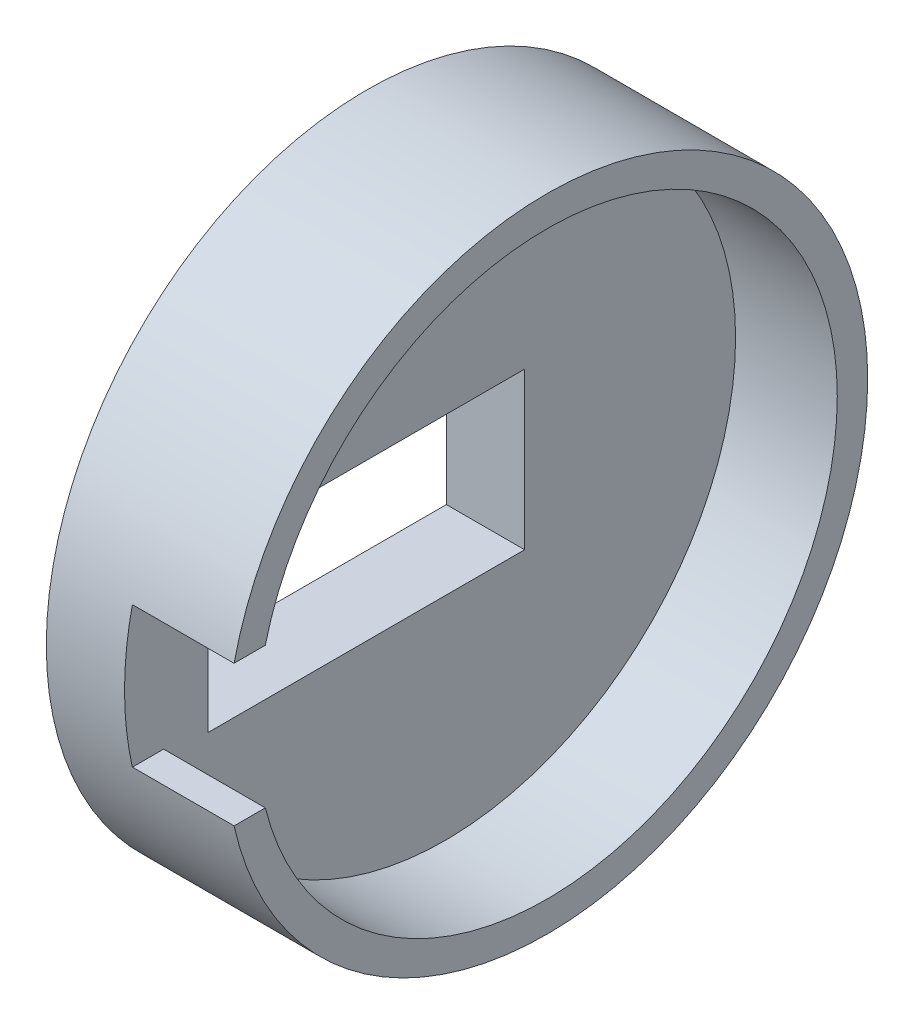
ISO-10303-21;
HEADER;
FILE_DESCRIPTION(('STEP AP214'),'2;1');
FILE_NAME('part.step','',(''),(''),'','','');
FILE_SCHEMA(('AUTOMOTIVE_DESIGN { 1 0 10303 214 1 1 1 1 }'));
ENDSEC;
DATA;
#1=APPLICATION_CONTEXT('core data for automotive mechanical design processes');
#2=APPLICATION_PROTOCOL_DEFINITION('international standard','automotive_design',2000,#1);
#3=PRODUCT_CONTEXT('',#1,'mechanical');
#4=PRODUCT('Part','Part','',(#3));
#5=PRODUCT_RELATED_PRODUCT_CATEGORY('part','',(#4));
#6=PRODUCT_DEFINITION_FORMATION('','',#4);
#7=PRODUCT_DEFINITION_CONTEXT('part definition',#1,'design');
#8=PRODUCT_DEFINITION('design','',#6,#7);
#9=PRODUCT_DEFINITION_SHAPE('','',#8);
#10=(LENGTH_UNIT() NAMED_UNIT(*) SI_UNIT(.MILLI.,.METRE.));
#11=(NAMED_UNIT(*) PLANE_ANGLE_UNIT() SI_UNIT($,.RADIAN.));
#12=(NAMED_UNIT(*) SI_UNIT($,.STERADIAN.) SOLID_ANGLE_UNIT());
#13=UNCERTAINTY_MEASURE_WITH_UNIT(LENGTH_MEASURE(1.E-05),#10,'distance_accuracy_value','');
#14=(GEOMETRIC_REPRESENTATION_CONTEXT(3) GLOBAL_UNCERTAINTY_ASSIGNED_CONTEXT((#13)) GLOBAL_UNIT_ASSIGNED_CONTEXT((#10,
#11,#12)) REPRESENTATION_CONTEXT('',''));
#15=CARTESIAN_POINT('',(0.,0.,0.));
#16=DIRECTION('',(0.,0.,1.));
#17=DIRECTION('',(1.,0.,0.));
#18=AXIS2_PLACEMENT_3D('',#15,#16,#17);
#19=CARTESIAN_POINT('',(10.,-10.0000000000001,-10.1411010564595));
#20=DIRECTION('',(0.,-1.,0.));
#21=DIRECTION('',(0.,0.,-1.));
#22=AXIS2_PLACEMENT_3D('',#19,#20,#21);
#23=PLANE('',#22);
#24=DIRECTION('',(0.,0.,-1.));
#25=VECTOR('',#24,1.);
#26=CARTESIAN_POINT('',(-5.,-10.,0.));
#27=LINE('',#26,#25);
#28=CARTESIAN_POINT('',(-5.,-9.99999999999994,30.3588989435405));
#29=VERTEX_POINT('',#28);
#30=CARTESIAN_POINT('',(-5.,-10.0000000000001,-10.1411010564595));
#31=VERTEX_POINT('',#30);
#32=EDGE_CURVE('E65',#29,#31,#27,.T.);
#33=ORIENTED_EDGE('',*,*,#32,.T.);
#34=DIRECTION('',(-1.,0.,0.));
#35=VECTOR('',#34,1.);
#36=CARTESIAN_POINT('',(10.,-10.0000000000001,-10.1411010564595));
#37=LINE('',#36,#35);
#38=CARTESIAN_POINT('',(-15.,-10.0000000000001,-10.1411010564595));
#39=VERTEX_POINT('',#38);
#40=EDGE_CURVE('E169',#31,#39,#37,.T.);
#41=ORIENTED_EDGE('',*,*,#40,.T.);
#42=DIRECTION('',(0.,0.,1.));
#43=VECTOR('',#42,1.);
#44=CARTESIAN_POINT('',(-15.,-10.0000000000001,-10.1411010564595));
#45=LINE('',#44,#43);
#46=CARTESIAN_POINT('',(-15.,-9.99999999999994,30.3588989435405));
#47=VERTEX_POINT('',#46);
#48=EDGE_CURVE('E156',#39,#47,#45,.T.);
#49=ORIENTED_EDGE('',*,*,#48,.T.);
#50=DIRECTION('',(-1.,0.,0.));
#51=VECTOR('',#50,1.);
#52=CARTESIAN_POINT('',(10.,-9.99999999999994,30.3588989435405));
#53=LINE('',#52,#51);
#54=EDGE_CURVE('E168',#29,#47,#53,.T.);
#55=ORIENTED_EDGE('',*,*,#54,.F.);
#56=EDGE_LOOP('',(#33,#41,#49,#55));
#57=FACE_BOUND('',#56,.T.);
#58=ADVANCED_FACE('F42',(#57),#23,.F.);
#59=CARTESIAN_POINT('',(10.,9.99999999999993,-10.1411010564595));
#60=DIRECTION('',(0.,0.,-1.));
#61=DIRECTION('',(0.,1.,0.));
#62=AXIS2_PLACEMENT_3D('',#59,#60,#61);
#63=PLANE('',#62);
#64=DIRECTION('',(0.,-1.,0.));
#65=VECTOR('',#64,1.);
#66=CARTESIAN_POINT('',(-5.,9.99999999999993,-10.1411010564595));
#67=LINE('',#66,#65);
#68=CARTESIAN_POINT('',(-5.,9.99999999999993,-10.1411010564595));
#69=VERTEX_POINT('',#68);
#70=EDGE_CURVE('E148',#69,#31,#67,.T.);
#71=ORIENTED_EDGE('',*,*,#70,.F.);
#72=DIRECTION('',(-1.,0.,0.));
#73=VECTOR('',#72,1.);
#74=CARTESIAN_POINT('',(10.,9.99999999999993,-10.1411010564595));
#75=LINE('',#74,#73);
#76=CARTESIAN_POINT('',(-15.,9.99999999999993,-10.1411010564595));
#77=VERTEX_POINT('',#76);
#78=EDGE_CURVE('E172',#69,#77,#75,.T.);
#79=ORIENTED_EDGE('',*,*,#78,.T.);
#80=DIRECTION('',(0.,-1.,0.));
#81=VECTOR('',#80,1.);
#82=CARTESIAN_POINT('',(-15.,9.99999999999993,-10.1411010564595));
#83=LINE('',#82,#81);
#84=EDGE_CURVE('E165',#77,#39,#83,.T.);
#85=ORIENTED_EDGE('',*,*,#84,.T.);
#86=ORIENTED_EDGE('',*,*,#40,.F.);
#87=EDGE_LOOP('',(#71,#79,#85,#86));
#88=FACE_BOUND('',#87,.T.);
#89=ADVANCED_FACE('F208',(#88),#63,.F.);
#90=CARTESIAN_POINT('',(10.,10.0000000000001,30.3588989435405));
#91=DIRECTION('',(0.,1.,0.));
#92=DIRECTION('',(0.,0.,1.));
#93=AXIS2_PLACEMENT_3D('',#90,#91,#92);
#94=PLANE('',#93);
#95=ORIENTED_EDGE('',*,*,#78,.F.);
#96=DIRECTION('',(0.,0.,1.));
#97=VECTOR('',#96,1.);
#98=CARTESIAN_POINT('',(-5.,9.99999999999996,0.));
#99=LINE('',#98,#97);
#100=CARTESIAN_POINT('',(-5.,10.0000000000001,30.3588989435405));
#101=VERTEX_POINT('',#100);
#102=EDGE_CURVE('E171',#69,#101,#99,.T.);
#103=ORIENTED_EDGE('',*,*,#102,.T.);
#104=DIRECTION('',(-1.,0.,0.));
#105=VECTOR('',#104,1.);
#106=CARTESIAN_POINT('',(10.,10.0000000000001,30.3588989435405));
#107=LINE('',#106,#105);
#108=CARTESIAN_POINT('',(-15.,10.0000000000001,30.3588989435405));
#109=VERTEX_POINT('',#108);
#110=EDGE_CURVE('E174',#101,#109,#107,.T.);
#111=ORIENTED_EDGE('',*,*,#110,.T.);
#112=DIRECTION('',(0.,0.,-1.));
#113=VECTOR('',#112,1.);
#114=CARTESIAN_POINT('',(-15.,10.0000000000001,30.3588989435405));
#115=LINE('',#114,#113);
#116=EDGE_CURVE('E162',#109,#77,#115,.T.);
#117=ORIENTED_EDGE('',*,*,#116,.T.);
#118=EDGE_LOOP('',(#95,#103,#111,#117));
#119=FACE_BOUND('',#118,.T.);
#120=ADVANCED_FACE('F202',(#119),#94,.F.);
#121=CARTESIAN_POINT('',(10.,-9.99999999999994,30.3588989435405));
#122=DIRECTION('',(0.,0.,1.));
#123=DIRECTION('',(0.,-1.,0.));
#124=AXIS2_PLACEMENT_3D('',#121,#122,#123);
#125=PLANE('',#124);
#126=DIRECTION('',(0.,1.,0.));
#127=VECTOR('',#126,1.);
#128=CARTESIAN_POINT('',(-5.,1.05328589404334E-13,30.3588989435405));
#129=LINE('',#128,#127);
#130=EDGE_CURVE('E146',#29,#101,#129,.T.);
#131=ORIENTED_EDGE('',*,*,#130,.F.);
#132=ORIENTED_EDGE('',*,*,#54,.T.);
#133=DIRECTION('',(0.,1.,0.));
#134=VECTOR('',#133,1.);
#135=CARTESIAN_POINT('',(-15.,-9.99999999999994,30.3588989435405));
#136=LINE('',#135,#134);
#137=EDGE_CURVE('E159',#47,#109,#136,.T.);
#138=ORIENTED_EDGE('',*,*,#137,.T.);
#139=ORIENTED_EDGE('',*,*,#110,.F.);
#140=EDGE_LOOP('',(#131,#132,#138,#139));
#141=FACE_BOUND('',#140,.T.);
#142=ADVANCED_FACE('F196',(#141),#125,.F.);
#143=CARTESIAN_POINT('',(10.,0.,0.));
#144=DIRECTION('',(-1.,0.,0.));
#145=DIRECTION('',(0.,0.,1.));
#146=AXIS2_PLACEMENT_3D('',#143,#144,#145);
#147=CYLINDRICAL_SURFACE('',#146,41.);
#148=CARTESIAN_POINT('',(-15.,0.,0.));
#149=DIRECTION('',(-1.,0.,0.));
#150=DIRECTION('',(0.,0.,1.));
#151=AXIS2_PLACEMENT_3D('',#148,#149,#150);
#152=CIRCLE('',#151,41.);
#153=CARTESIAN_POINT('',(-15.,0.,41.));
#154=VERTEX_POINT('',#153);
#155=EDGE_CURVE('E180',#154,#154,#152,.T.);
#156=ORIENTED_EDGE('',*,*,#155,.F.);
#157=EDGE_LOOP('',(#156));
#158=FACE_BOUND('',#157,.T.);
#159=CARTESIAN_POINT('',(-5.,0.,0.));
#160=DIRECTION('',(1.,0.,0.));
#161=DIRECTION('',(0.,0.,-1.));
#162=AXIS2_PLACEMENT_3D('',#159,#160,#161);
#163=CIRCLE('',#162,41.);
#164=CARTESIAN_POINT('',(-5.,8.9999999999999,40.));
#165=VERTEX_POINT('',#164);
#166=CARTESIAN_POINT('',(-5.,-8.98676225304479,40.0029761918691));
#167=VERTEX_POINT('',#166);
#168=EDGE_CURVE('E129',#165,#167,#163,.T.);
#169=ORIENTED_EDGE('',*,*,#168,.F.);
#170=DIRECTION('',(1.,0.,0.));
#171=VECTOR('',#170,1.);
#172=CARTESIAN_POINT('',(-5.,8.9999999999999,40.));
#173=LINE('',#172,#171);
#174=CARTESIAN_POINT('',(8.,8.9999999999999,40.));
#175=VERTEX_POINT('',#174);
#176=EDGE_CURVE('E133',#165,#175,#173,.T.);
#177=ORIENTED_EDGE('',*,*,#176,.T.);
#178=CARTESIAN_POINT('',(8.,0.,0.));
#179=DIRECTION('',(1.,0.,0.));
#180=DIRECTION('',(0.,0.,-1.));
#181=AXIS2_PLACEMENT_3D('',#178,#179,#180);
#182=CIRCLE('',#181,40.9999999999999);
#183=CARTESIAN_POINT('',(8.,-8.98676225304477,40.0029761918691));
#184=VERTEX_POINT('',#183);
#185=EDGE_CURVE('E150',#184,#175,#182,.T.);
#186=ORIENTED_EDGE('',*,*,#185,.F.);
#187=DIRECTION('',(-1.,0.,0.));
#188=VECTOR('',#187,1.);
#189=CARTESIAN_POINT('',(10.,-8.9867622530448,40.0029761918691));
#190=LINE('',#189,#188);
#191=EDGE_CURVE('E57',#184,#167,#190,.T.);
#192=ORIENTED_EDGE('',*,*,#191,.T.);
#193=EDGE_LOOP('',(#169,#177,#186,#192));
#194=FACE_BOUND('',#193,.T.);
#195=ADVANCED_FACE('F194',(#158,#194),#147,.T.);
#196=CARTESIAN_POINT('',(10.,0.,0.));
#197=DIRECTION('',(-1.,0.,0.));
#198=DIRECTION('',(0.,0.,1.));
#199=AXIS2_PLACEMENT_3D('',#196,#197,#198);
#200=CYLINDRICAL_SURFACE('',#199,37.1125);
#201=DIRECTION('',(-1.,0.,0.));
#202=VECTOR('',#201,1.);
#203=CARTESIAN_POINT('',(10.,8.9999999999999,36.0046893647203));
#204=LINE('',#203,#202);
#205=CARTESIAN_POINT('',(-5.,8.9999999999999,36.0046893647203));
#206=VERTEX_POINT('',#205);
#207=CARTESIAN_POINT('',(8.,8.9999999999999,36.0046893647203));
#208=VERTEX_POINT('',#207);
#209=EDGE_CURVE('E141',#206,#208,#204,.F.);
#210=ORIENTED_EDGE('',*,*,#209,.F.);
#211=CARTESIAN_POINT('',(-5.,0.,0.));
#212=DIRECTION('',(1.,0.,0.));
#213=DIRECTION('',(0.,0.,-1.));
#214=AXIS2_PLACEMENT_3D('',#211,#212,#213);
#215=CIRCLE('',#214,37.1125);
#216=CARTESIAN_POINT('',(-5.,-9.0000000000001,36.0046893647202));
#217=VERTEX_POINT('',#216);
#218=EDGE_CURVE('E144',#217,#206,#215,.T.);
#219=ORIENTED_EDGE('',*,*,#218,.F.);
#220=DIRECTION('',(-1.,0.,0.));
#221=VECTOR('',#220,1.);
#222=CARTESIAN_POINT('',(10.,-9.0000000000001,36.0046893647202));
#223=LINE('',#222,#221);
#224=CARTESIAN_POINT('',(8.,-9.0000000000001,36.0046893647202));
#225=VERTEX_POINT('',#224);
#226=EDGE_CURVE('E120',#217,#225,#223,.F.);
#227=ORIENTED_EDGE('',*,*,#226,.T.);
#228=CARTESIAN_POINT('',(8.,0.,0.));
#229=DIRECTION('',(1.,0.,0.));
#230=DIRECTION('',(0.,0.,-1.));
#231=AXIS2_PLACEMENT_3D('',#228,#229,#230);
#232=CIRCLE('',#231,37.1125);
#233=EDGE_CURVE('E153',#225,#208,#232,.T.);
#234=ORIENTED_EDGE('',*,*,#233,.T.);
#235=EDGE_LOOP('',(#210,#219,#227,#234));
#236=FACE_BOUND('',#235,.T.);
#237=ADVANCED_FACE('F44',(#236),#200,.F.);
#238=CARTESIAN_POINT('',(-5.,0.,0.));
#239=DIRECTION('',(1.,0.,0.));
#240=DIRECTION('',(0.,0.,-1.));
#241=AXIS2_PLACEMENT_3D('',#238,#239,#240);
#242=PLANE('',#241);
#243=ORIENTED_EDGE('',*,*,#218,.T.);
#244=DIRECTION('',(0.,0.,1.));
#245=VECTOR('',#244,1.);
#246=CARTESIAN_POINT('',(-5.,8.9999999999999,0.));
#247=LINE('',#246,#245);
#248=EDGE_CURVE('E124',#206,#165,#247,.T.);
#249=ORIENTED_EDGE('',*,*,#248,.T.);
#250=ORIENTED_EDGE('',*,*,#168,.T.);
#251=DIRECTION('',(0.,-0.723037999726053,-0.690808259180613));
#252=VECTOR('',#251,1.);
#253=CARTESIAN_POINT('',(-5.,-24.269338619897,25.4016274663803));
#254=LINE('',#253,#252);
#255=CARTESIAN_POINT('',(-5.,-9.0000000000001,39.9903285233743));
#256=VERTEX_POINT('',#255);
#257=EDGE_CURVE('E125',#167,#256,#254,.T.);
#258=ORIENTED_EDGE('',*,*,#257,.T.);
#259=DIRECTION('',(0.,0.,1.));
#260=VECTOR('',#259,1.);
#261=CARTESIAN_POINT('',(-5.,-9.0000000000001,0.));
#262=LINE('',#261,#260);
#263=EDGE_CURVE('E113',#217,#256,#262,.T.);
#264=ORIENTED_EDGE('',*,*,#263,.F.);
#265=EDGE_LOOP('',(#243,#249,#250,#258,#264));
#266=FACE_BOUND('',#265,.T.);
#267=ORIENTED_EDGE('',*,*,#130,.T.);
#268=ORIENTED_EDGE('',*,*,#102,.F.);
#269=ORIENTED_EDGE('',*,*,#70,.T.);
#270=ORIENTED_EDGE('',*,*,#32,.F.);
#271=EDGE_LOOP('',(#267,#268,#269,#270));
#272=FACE_BOUND('',#271,.T.);
#273=ADVANCED_FACE('F127',(#266,#272),#242,.T.);
#274=CARTESIAN_POINT('',(-15.,0.,0.));
#275=DIRECTION('',(-1.,0.,0.));
#276=DIRECTION('',(0.,0.,1.));
#277=AXIS2_PLACEMENT_3D('',#274,#275,#276);
#278=PLANE('',#277);
#279=ORIENTED_EDGE('',*,*,#48,.F.);
#280=ORIENTED_EDGE('',*,*,#84,.F.);
#281=ORIENTED_EDGE('',*,*,#116,.F.);
#282=ORIENTED_EDGE('',*,*,#137,.F.);
#283=EDGE_LOOP('',(#279,#280,#281,#282));
#284=FACE_BOUND('',#283,.T.);
#285=ORIENTED_EDGE('',*,*,#155,.T.);
#286=EDGE_LOOP('',(#285));
#287=FACE_BOUND('',#286,.T.);
#288=ADVANCED_FACE('F218',(#284,#287),#278,.T.);
#289=CARTESIAN_POINT('',(8.,0.,0.));
#290=DIRECTION('',(1.,0.,0.));
#291=DIRECTION('',(0.,0.,-1.));
#292=AXIS2_PLACEMENT_3D('',#289,#290,#291);
#293=PLANE('',#292);
#294=DIRECTION('',(0.,0.,1.));
#295=VECTOR('',#294,1.);
#296=CARTESIAN_POINT('',(8.,8.9999999999999,0.));
#297=LINE('',#296,#295);
#298=EDGE_CURVE('E12',#208,#175,#297,.T.);
#299=ORIENTED_EDGE('',*,*,#298,.F.);
#300=ORIENTED_EDGE('',*,*,#233,.F.);
#301=DIRECTION('',(0.,0.,1.));
#302=VECTOR('',#301,1.);
#303=CARTESIAN_POINT('',(8.,-9.0000000000001,0.));
#304=LINE('',#303,#302);
#305=CARTESIAN_POINT('',(8.,-9.0000000000001,39.9903285233743));
#306=VERTEX_POINT('',#305);
#307=EDGE_CURVE('E50',#225,#306,#304,.T.);
#308=ORIENTED_EDGE('',*,*,#307,.T.);
#309=DIRECTION('',(0.,-0.723037999726053,-0.690808259180613));
#310=VECTOR('',#309,1.);
#311=CARTESIAN_POINT('',(8.,-24.2693386198969,25.4016274663804));
#312=LINE('',#311,#310);
#313=EDGE_CURVE('E132',#184,#306,#312,.T.);
#314=ORIENTED_EDGE('',*,*,#313,.F.);
#315=ORIENTED_EDGE('',*,*,#185,.T.);
#316=EDGE_LOOP('',(#299,#300,#308,#314,#315));
#317=FACE_BOUND('',#316,.T.);
#318=ADVANCED_FACE('F186',(#317),#293,.T.);
#319=CARTESIAN_POINT('',(-5.,-24.269338619897,25.4016274663803));
#320=DIRECTION('',(0.,-0.690808259180613,0.723037999726053));
#321=DIRECTION('',(0.,-0.723037999726053,-0.690808259180613));
#322=AXIS2_PLACEMENT_3D('',#319,#320,#321);
#323=PLANE('',#322);
#324=ORIENTED_EDGE('',*,*,#313,.T.);
#325=DIRECTION('',(1.,0.,0.));
#326=VECTOR('',#325,1.);
#327=CARTESIAN_POINT('',(-5.,-9.0000000000001,39.9903285233743));
#328=LINE('',#327,#326);
#329=EDGE_CURVE('E117',#256,#306,#328,.T.);
#330=ORIENTED_EDGE('',*,*,#329,.F.);
#331=ORIENTED_EDGE('',*,*,#257,.F.);
#332=ORIENTED_EDGE('',*,*,#191,.F.);
#333=EDGE_LOOP('',(#324,#330,#331,#332));
#334=FACE_BOUND('',#333,.T.);
#335=ADVANCED_FACE('F131',(#334),#323,.F.);
#336=CARTESIAN_POINT('',(-5.,8.9999999999999,0.));
#337=DIRECTION('',(0.,1.,0.));
#338=DIRECTION('',(0.,0.,1.));
#339=AXIS2_PLACEMENT_3D('',#336,#337,#338);
#340=PLANE('',#339);
#341=ORIENTED_EDGE('',*,*,#209,.T.);
#342=ORIENTED_EDGE('',*,*,#298,.T.);
#343=ORIENTED_EDGE('',*,*,#176,.F.);
#344=ORIENTED_EDGE('',*,*,#248,.F.);
#345=EDGE_LOOP('',(#341,#342,#343,#344));
#346=FACE_BOUND('',#345,.T.);
#347=ADVANCED_FACE('F192',(#346),#340,.F.);
#348=CARTESIAN_POINT('',(-5.,-9.0000000000001,0.));
#349=DIRECTION('',(0.,1.,0.));
#350=DIRECTION('',(0.,0.,1.));
#351=AXIS2_PLACEMENT_3D('',#348,#349,#350);
#352=PLANE('',#351);
#353=ORIENTED_EDGE('',*,*,#263,.T.);
#354=ORIENTED_EDGE('',*,*,#329,.T.);
#355=ORIENTED_EDGE('',*,*,#307,.F.);
#356=ORIENTED_EDGE('',*,*,#226,.F.);
#357=EDGE_LOOP('',(#353,#354,#355,#356));
#358=FACE_BOUND('',#357,.T.);
#359=ADVANCED_FACE('F115',(#358),#352,.T.);
#360=CLOSED_SHELL('',(#58,#89,#120,#142,#195,#237,#273,#288,#318,#335,#347,#359));
#361=MANIFOLD_SOLID_BREP('B2',#360);
#362=ADVANCED_BREP_SHAPE_REPRESENTATION('',(#18,#361),#14);
#363=SHAPE_DEFINITION_REPRESENTATION(#9,#362);
ENDSEC;
END-ISO-10303-21;
